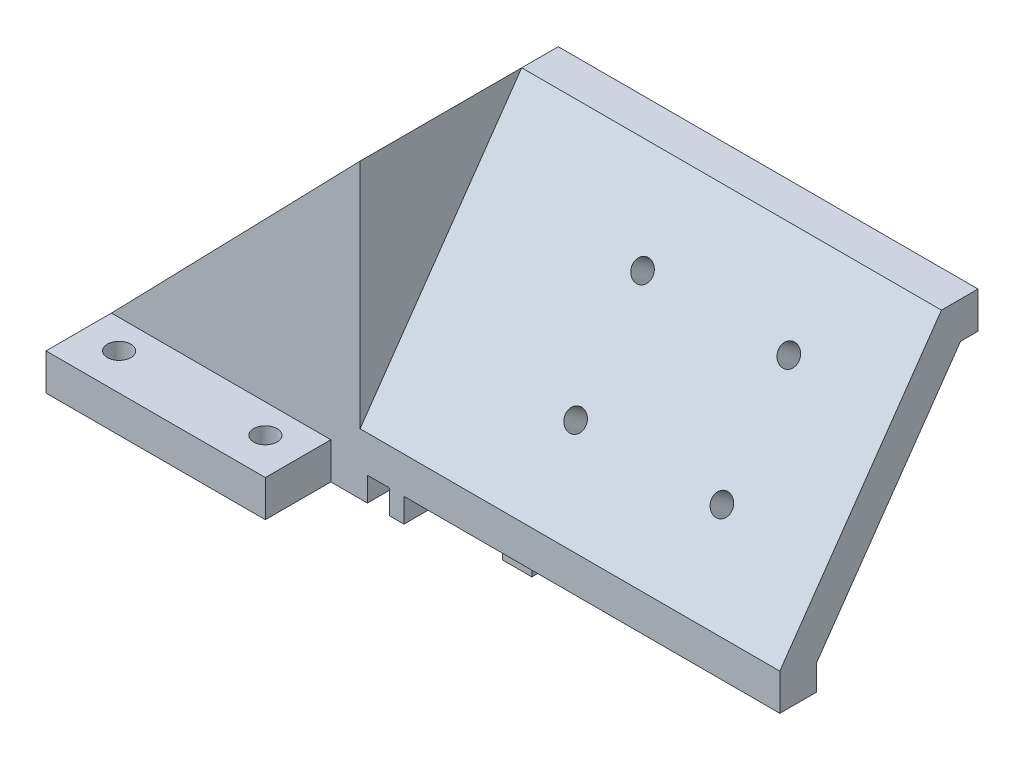
ISO-10303-21;
HEADER;
FILE_DESCRIPTION(('STEP AP214'),'2;1');
FILE_NAME('part.step','',(''),(''),'','','');
FILE_SCHEMA(('AUTOMOTIVE_DESIGN { 1 0 10303 214 1 1 1 1 }'));
ENDSEC;
DATA;
#1=APPLICATION_CONTEXT('core data for automotive mechanical design processes');
#2=APPLICATION_PROTOCOL_DEFINITION('international standard','automotive_design',2000,#1);
#3=PRODUCT_CONTEXT('',#1,'mechanical');
#4=PRODUCT('Part','Part','',(#3));
#5=PRODUCT_RELATED_PRODUCT_CATEGORY('part','',(#4));
#6=PRODUCT_DEFINITION_FORMATION('','',#4);
#7=PRODUCT_DEFINITION_CONTEXT('part definition',#1,'design');
#8=PRODUCT_DEFINITION('design','',#6,#7);
#9=PRODUCT_DEFINITION_SHAPE('','',#8);
#10=(LENGTH_UNIT() NAMED_UNIT(*) SI_UNIT(.MILLI.,.METRE.));
#11=(NAMED_UNIT(*) PLANE_ANGLE_UNIT() SI_UNIT($,.RADIAN.));
#12=(NAMED_UNIT(*) SI_UNIT($,.STERADIAN.) SOLID_ANGLE_UNIT());
#13=UNCERTAINTY_MEASURE_WITH_UNIT(LENGTH_MEASURE(1.E-05),#10,'distance_accuracy_value','');
#14=(GEOMETRIC_REPRESENTATION_CONTEXT(3) GLOBAL_UNCERTAINTY_ASSIGNED_CONTEXT((#13)) GLOBAL_UNIT_ASSIGNED_CONTEXT((#10,
#11,#12)) REPRESENTATION_CONTEXT('',''));
#15=CARTESIAN_POINT('',(0.,0.,0.));
#16=DIRECTION('',(0.,0.,1.));
#17=DIRECTION('',(1.,0.,0.));
#18=AXIS2_PLACEMENT_3D('',#15,#16,#17);
#19=CARTESIAN_POINT('',(30.,3.3,0.));
#20=DIRECTION('',(0.,1.,0.));
#21=DIRECTION('',(0.,0.,1.));
#22=AXIS2_PLACEMENT_3D('',#19,#20,#21);
#23=PLANE('',#22);
#24=DIRECTION('',(0.,0.,1.));
#25=VECTOR('',#24,1.);
#26=CARTESIAN_POINT('',(106.4,3.3,-13.55));
#27=LINE('',#26,#25);
#28=CARTESIAN_POINT('',(106.4,3.30000000000001,8.55000000000001));
#29=VERTEX_POINT('',#28);
#30=CARTESIAN_POINT('',(106.4,3.3,13.55));
#31=VERTEX_POINT('',#30);
#32=EDGE_CURVE('E465',#29,#31,#27,.T.);
#33=ORIENTED_EDGE('',*,*,#32,.T.);
#34=DIRECTION('',(1.,0.,0.));
#35=VECTOR('',#34,1.);
#36=CARTESIAN_POINT('',(30.,3.3,13.55));
#37=LINE('',#36,#35);
#38=CARTESIAN_POINT('',(55.,3.3,13.55));
#39=VERTEX_POINT('',#38);
#40=EDGE_CURVE('E334',#39,#31,#37,.T.);
#41=ORIENTED_EDGE('',*,*,#40,.F.);
#42=DIRECTION('',(0.,0.,-1.));
#43=VECTOR('',#42,1.);
#44=CARTESIAN_POINT('',(55.,3.3,0.));
#45=LINE('',#44,#43);
#46=CARTESIAN_POINT('',(55.,3.3,-13.55));
#47=VERTEX_POINT('',#46);
#48=EDGE_CURVE('E263',#39,#47,#45,.T.);
#49=ORIENTED_EDGE('',*,*,#48,.T.);
#50=DIRECTION('',(1.,0.,0.));
#51=VECTOR('',#50,1.);
#52=CARTESIAN_POINT('',(30.,3.3,-13.55));
#53=LINE('',#52,#51);
#54=CARTESIAN_POINT('',(66.,3.3,-13.55));
#55=VERTEX_POINT('',#54);
#56=EDGE_CURVE('E330',#47,#55,#53,.T.);
#57=ORIENTED_EDGE('',*,*,#56,.T.);
#58=DIRECTION('',(0.,0.,-1.));
#59=VECTOR('',#58,1.);
#60=CARTESIAN_POINT('',(66.,3.3,0.));
#61=LINE('',#60,#59);
#62=CARTESIAN_POINT('',(66.,3.3,11.05));
#63=VERTEX_POINT('',#62);
#64=EDGE_CURVE('E300',#63,#55,#61,.T.);
#65=ORIENTED_EDGE('',*,*,#64,.F.);
#66=DIRECTION('',(-1.,0.,0.));
#67=VECTOR('',#66,1.);
#68=CARTESIAN_POINT('',(30.,3.3,11.05));
#69=LINE('',#68,#67);
#70=CARTESIAN_POINT('',(70.,3.3,11.05));
#71=VERTEX_POINT('',#70);
#72=EDGE_CURVE('E314',#71,#63,#69,.T.);
#73=ORIENTED_EDGE('',*,*,#72,.F.);
#74=DIRECTION('',(0.,0.,-1.));
#75=VECTOR('',#74,1.);
#76=CARTESIAN_POINT('',(70.,3.3,0.));
#77=LINE('',#76,#75);
#78=CARTESIAN_POINT('',(70.,3.30000000000001,8.55000000000001));
#79=VERTEX_POINT('',#78);
#80=EDGE_CURVE('E304',#71,#79,#77,.T.);
#81=ORIENTED_EDGE('',*,*,#80,.T.);
#82=DIRECTION('',(-1.,0.,0.));
#83=VECTOR('',#82,1.);
#84=CARTESIAN_POINT('',(97.,3.30000000000001,8.55000000000001));
#85=LINE('',#84,#83);
#86=EDGE_CURVE('E413',#29,#79,#85,.T.);
#87=ORIENTED_EDGE('',*,*,#86,.F.);
#88=EDGE_LOOP('',(#33,#41,#49,#57,#65,#73,#81,#87));
#89=FACE_BOUND('',#88,.T.);
#90=ADVANCED_FACE('F45',(#89),#23,.F.);
#91=CARTESIAN_POINT('',(92.,8.40856632282748,-34.0678446970446));
#92=DIRECTION('',(0.,0.571898215133174,0.820324589127675));
#93=DIRECTION('',(0.,-0.820324589127675,0.571898215133174));
#94=AXIS2_PLACEMENT_3D('',#91,#92,#93);
#95=CYLINDRICAL_SURFACE('',#94,1.4);
#96=CARTESIAN_POINT('',(92.,30.7125967130213,-2.0751857210653));
#97=DIRECTION('',(0.,-0.571898215133174,-0.820324589127675));
#98=DIRECTION('',(0.,-0.820324589127675,0.571898215133174));
#99=AXIS2_PLACEMENT_3D('',#96,#97,#98);
#100=CIRCLE('',#99,1.4);
#101=CARTESIAN_POINT('',(92.,29.5641422882425,-1.27452821987885));
#102=VERTEX_POINT('',#101);
#103=EDGE_CURVE('E251',#102,#102,#100,.T.);
#104=ORIENTED_EDGE('',*,*,#103,.F.);
#105=EDGE_LOOP('',(#104));
#106=FACE_BOUND('',#105,.T.);
#107=CARTESIAN_POINT('',(92.,27.8531056373554,-6.17680866670368));
#108=DIRECTION('',(0.,0.571898215133175,0.820324589127675));
#109=DIRECTION('',(0.,0.820324589127675,-0.571898215133175));
#110=AXIS2_PLACEMENT_3D('',#107,#108,#109);
#111=CIRCLE('',#110,1.4);
#112=CARTESIAN_POINT('',(92.,29.0015600621342,-6.97746616789013));
#113=VERTEX_POINT('',#112);
#114=EDGE_CURVE('E456',#113,#113,#111,.F.);
#115=ORIENTED_EDGE('',*,*,#114,.T.);
#116=EDGE_LOOP('',(#115));
#117=FACE_BOUND('',#116,.T.);
#118=ADVANCED_FACE('F487',(#106,#117),#95,.F.);
#119=CARTESIAN_POINT('',(71.9999954707796,-4.71662710321463,-24.9174732549143));
#120=DIRECTION('',(0.,0.571898215133174,0.820324589127675));
#121=DIRECTION('',(0.,-0.820324589127675,0.571898215133174));
#122=AXIS2_PLACEMENT_3D('',#119,#120,#121);
#123=CYLINDRICAL_SURFACE('',#122,1.4);
#124=CARTESIAN_POINT('',(71.9999954707796,17.5874032869792,7.07518572106501));
#125=DIRECTION('',(0.,-0.571898215133174,-0.820324589127675));
#126=DIRECTION('',(0.,-0.820324589127675,0.571898215133174));
#127=AXIS2_PLACEMENT_3D('',#124,#125,#126);
#128=CIRCLE('',#127,1.4);
#129=CARTESIAN_POINT('',(71.9999954707796,16.4389488622004,7.87584322225145));
#130=VERTEX_POINT('',#129);
#131=EDGE_CURVE('E474',#130,#130,#128,.T.);
#132=ORIENTED_EDGE('',*,*,#131,.F.);
#133=EDGE_LOOP('',(#132));
#134=FACE_BOUND('',#133,.T.);
#135=CARTESIAN_POINT('',(71.9999954707796,14.7279122113133,2.97356277542663));
#136=DIRECTION('',(0.,0.571898215133175,0.820324589127675));
#137=DIRECTION('',(0.,0.820324589127675,-0.571898215133175));
#138=AXIS2_PLACEMENT_3D('',#135,#136,#137);
#139=CIRCLE('',#138,1.4);
#140=CARTESIAN_POINT('',(71.9999954707796,15.8763666360921,2.17290527424019));
#141=VERTEX_POINT('',#140);
#142=EDGE_CURVE('E453',#141,#141,#139,.F.);
#143=ORIENTED_EDGE('',*,*,#142,.T.);
#144=EDGE_LOOP('',(#143));
#145=FACE_BOUND('',#144,.T.);
#146=ADVANCED_FACE('F490',(#134,#145),#123,.F.);
#147=CARTESIAN_POINT('',(72.,8.40856632282771,-34.0678446970448));
#148=DIRECTION('',(0.,0.571898215133174,0.820324589127675));
#149=DIRECTION('',(0.,-0.820324589127675,0.571898215133174));
#150=AXIS2_PLACEMENT_3D('',#147,#148,#149);
#151=CYLINDRICAL_SURFACE('',#150,1.4);
#152=CARTESIAN_POINT('',(72.,30.7125967130215,-2.07518572106546));
#153=DIRECTION('',(0.,-0.571898215133174,-0.820324589127675));
#154=DIRECTION('',(0.,-0.820324589127675,0.571898215133174));
#155=AXIS2_PLACEMENT_3D('',#152,#153,#154);
#156=CIRCLE('',#155,1.4);
#157=CARTESIAN_POINT('',(72.,29.5641422882428,-1.27452821987901));
#158=VERTEX_POINT('',#157);
#159=EDGE_CURVE('E477',#158,#158,#156,.T.);
#160=ORIENTED_EDGE('',*,*,#159,.F.);
#161=EDGE_LOOP('',(#160));
#162=FACE_BOUND('',#161,.T.);
#163=CARTESIAN_POINT('',(72.,27.8531056373556,-6.17680866670384));
#164=DIRECTION('',(0.,0.571898215133175,0.820324589127675));
#165=DIRECTION('',(0.,0.820324589127675,-0.571898215133175));
#166=AXIS2_PLACEMENT_3D('',#163,#164,#165);
#167=CIRCLE('',#166,1.4);
#168=CARTESIAN_POINT('',(72.,29.0015600621344,-6.97746616789029));
#169=VERTEX_POINT('',#168);
#170=EDGE_CURVE('E412',#169,#169,#167,.F.);
#171=ORIENTED_EDGE('',*,*,#170,.T.);
#172=EDGE_LOOP('',(#171));
#173=FACE_BOUND('',#172,.T.);
#174=ADVANCED_FACE('F687',(#162,#173),#151,.F.);
#175=CARTESIAN_POINT('',(91.9999954707796,-4.7166271032148,-24.9174732549142));
#176=DIRECTION('',(0.,0.571898215133174,0.820324589127675));
#177=DIRECTION('',(0.,-0.820324589127675,0.571898215133174));
#178=AXIS2_PLACEMENT_3D('',#175,#176,#177);
#179=CYLINDRICAL_SURFACE('',#178,1.4);
#180=CARTESIAN_POINT('',(91.9999954707796,17.587403286979,7.07518572106513));
#181=DIRECTION('',(0.,-0.571898215133174,-0.820324589127675));
#182=DIRECTION('',(0.,-0.820324589127675,0.571898215133174));
#183=AXIS2_PLACEMENT_3D('',#180,#181,#182);
#184=CIRCLE('',#183,1.4);
#185=CARTESIAN_POINT('',(91.9999954707796,16.4389488622003,7.87584322225157));
#186=VERTEX_POINT('',#185);
#187=EDGE_CURVE('E473',#186,#186,#184,.T.);
#188=ORIENTED_EDGE('',*,*,#187,.F.);
#189=EDGE_LOOP('',(#188));
#190=FACE_BOUND('',#189,.T.);
#191=CARTESIAN_POINT('',(91.9999954707796,14.7279122113131,2.97356277542675));
#192=DIRECTION('',(0.,0.571898215133175,0.820324589127675));
#193=DIRECTION('',(0.,0.820324589127675,-0.571898215133175));
#194=AXIS2_PLACEMENT_3D('',#191,#192,#193);
#195=CIRCLE('',#194,1.4);
#196=CARTESIAN_POINT('',(91.9999954707796,15.8763666360919,2.1729052742403));
#197=VERTEX_POINT('',#196);
#198=EDGE_CURVE('E409',#197,#197,#195,.F.);
#199=ORIENTED_EDGE('',*,*,#198,.T.);
#200=EDGE_LOOP('',(#199));
#201=FACE_BOUND('',#200,.T.);
#202=ADVANCED_FACE('F683',(#190,#201),#179,.F.);
#203=CARTESIAN_POINT('',(30.,3.3,13.55));
#204=DIRECTION('',(0.,0.,-1.));
#205=DIRECTION('',(1.,0.,0.));
#206=AXIS2_PLACEMENT_3D('',#203,#204,#205);
#207=PLANE('',#206);
#208=DIRECTION('',(1.,0.,0.));
#209=VECTOR('',#208,1.);
#210=CARTESIAN_POINT('',(30.,5.,13.55));
#211=LINE('',#210,#209);
#212=CARTESIAN_POINT('',(15.,5.,13.55));
#213=VERTEX_POINT('',#212);
#214=CARTESIAN_POINT('',(45.,5.,13.55));
#215=VERTEX_POINT('',#214);
#216=EDGE_CURVE('E401',#213,#215,#211,.T.);
#217=ORIENTED_EDGE('',*,*,#216,.T.);
#218=DIRECTION('',(0.,1.,0.));
#219=VECTOR('',#218,1.);
#220=CARTESIAN_POINT('',(45.,5.,13.55));
#221=LINE('',#220,#219);
#222=CARTESIAN_POINT('',(45.,0.,13.55));
#223=VERTEX_POINT('',#222);
#224=EDGE_CURVE('E338',#223,#215,#221,.T.);
#225=ORIENTED_EDGE('',*,*,#224,.F.);
#226=DIRECTION('',(1.,0.,0.));
#227=VECTOR('',#226,1.);
#228=CARTESIAN_POINT('',(30.,0.,13.55));
#229=LINE('',#228,#227);
#230=CARTESIAN_POINT('',(50.,0.,13.55));
#231=VERTEX_POINT('',#230);
#232=EDGE_CURVE('E285',#223,#231,#229,.T.);
#233=ORIENTED_EDGE('',*,*,#232,.T.);
#234=DIRECTION('',(0.,1.,0.));
#235=VECTOR('',#234,1.);
#236=CARTESIAN_POINT('',(50.,0.,13.55));
#237=LINE('',#236,#235);
#238=CARTESIAN_POINT('',(50.,3.3,13.55));
#239=VERTEX_POINT('',#238);
#240=EDGE_CURVE('E297',#231,#239,#237,.T.);
#241=ORIENTED_EDGE('',*,*,#240,.T.);
#242=CARTESIAN_POINT('',(53.,3.3,13.55));
#243=VERTEX_POINT('',#242);
#244=EDGE_CURVE('E335',#239,#243,#37,.T.);
#245=ORIENTED_EDGE('',*,*,#244,.T.);
#246=DIRECTION('',(0.,1.,0.));
#247=VECTOR('',#246,1.);
#248=CARTESIAN_POINT('',(53.,0.,13.55));
#249=LINE('',#248,#247);
#250=CARTESIAN_POINT('',(53.,0.,13.55));
#251=VERTEX_POINT('',#250);
#252=EDGE_CURVE('E281',#251,#243,#249,.T.);
#253=ORIENTED_EDGE('',*,*,#252,.F.);
#254=DIRECTION('',(1.,0.,0.));
#255=VECTOR('',#254,1.);
#256=CARTESIAN_POINT('',(30.,0.,13.55));
#257=LINE('',#256,#255);
#258=CARTESIAN_POINT('',(55.,0.,13.55));
#259=VERTEX_POINT('',#258);
#260=EDGE_CURVE('E262',#251,#259,#257,.T.);
#261=ORIENTED_EDGE('',*,*,#260,.T.);
#262=DIRECTION('',(0.,1.,0.));
#263=VECTOR('',#262,1.);
#264=CARTESIAN_POINT('',(55.,0.,13.55));
#265=LINE('',#264,#263);
#266=EDGE_CURVE('E279',#259,#39,#265,.T.);
#267=ORIENTED_EDGE('',*,*,#266,.T.);
#268=ORIENTED_EDGE('',*,*,#40,.T.);
#269=DIRECTION('',(0.,1.,0.));
#270=VECTOR('',#269,1.);
#271=CARTESIAN_POINT('',(106.4,40.,13.55));
#272=LINE('',#271,#270);
#273=CARTESIAN_POINT('',(106.4,8.3,13.55));
#274=VERTEX_POINT('',#273);
#275=EDGE_CURVE('E468',#31,#274,#272,.T.);
#276=ORIENTED_EDGE('',*,*,#275,.T.);
#277=DIRECTION('',(1.,0.,0.));
#278=VECTOR('',#277,1.);
#279=CARTESIAN_POINT('',(49.,8.3,13.55));
#280=LINE('',#279,#278);
#281=CARTESIAN_POINT('',(49.,8.3,13.55));
#282=VERTEX_POINT('',#281);
#283=EDGE_CURVE('E233',#282,#274,#280,.T.);
#284=ORIENTED_EDGE('',*,*,#283,.F.);
#285=DIRECTION('',(0.,1.,0.));
#286=VECTOR('',#285,1.);
#287=CARTESIAN_POINT('',(49.,0.,13.55));
#288=LINE('',#287,#286);
#289=CARTESIAN_POINT('',(49.,40.,13.55));
#290=VERTEX_POINT('',#289);
#291=EDGE_CURVE('E227',#282,#290,#288,.T.);
#292=ORIENTED_EDGE('',*,*,#291,.T.);
#293=DIRECTION('',(-0.696785684263249,-0.717279380859227,0.));
#294=VECTOR('',#293,1.);
#295=CARTESIAN_POINT('',(49.,40.,13.55));
#296=LINE('',#295,#294);
#297=EDGE_CURVE('E236',#290,#213,#296,.T.);
#298=ORIENTED_EDGE('',*,*,#297,.T.);
#299=EDGE_LOOP('',(#217,#225,#233,#241,#245,#253,#261,#267,#268,#276,#284,#292,#298));
#300=FACE_BOUND('',#299,.T.);
#301=ADVANCED_FACE('F247',(#300),#207,.F.);
#302=CARTESIAN_POINT('',(30.,40.,0.));
#303=DIRECTION('',(0.,1.,0.));
#304=DIRECTION('',(0.,0.,1.));
#305=AXIS2_PLACEMENT_3D('',#302,#303,#304);
#306=PLANE('',#305);
#307=DIRECTION('',(0.,0.,1.));
#308=VECTOR('',#307,1.);
#309=CARTESIAN_POINT('',(49.,40.,-22.5));
#310=LINE('',#309,#308);
#311=CARTESIAN_POINT('',(49.,40.,-13.55));
#312=VERTEX_POINT('',#311);
#313=CARTESIAN_POINT('',(49.,40.,-8.54999999999998));
#314=VERTEX_POINT('',#313);
#315=EDGE_CURVE('E245',#312,#314,#310,.T.);
#316=ORIENTED_EDGE('',*,*,#315,.T.);
#317=DIRECTION('',(1.,0.,0.));
#318=VECTOR('',#317,1.);
#319=CARTESIAN_POINT('',(49.,40.,-8.54999999999998));
#320=LINE('',#319,#318);
#321=CARTESIAN_POINT('',(106.4,40.,-8.54999999999999));
#322=VERTEX_POINT('',#321);
#323=EDGE_CURVE('E255',#314,#322,#320,.T.);
#324=ORIENTED_EDGE('',*,*,#323,.T.);
#325=DIRECTION('',(0.,0.,-1.));
#326=VECTOR('',#325,1.);
#327=CARTESIAN_POINT('',(106.4,40.,-13.55));
#328=LINE('',#327,#326);
#329=CARTESIAN_POINT('',(106.4,40.,-13.55));
#330=VERTEX_POINT('',#329);
#331=EDGE_CURVE('E470',#322,#330,#328,.T.);
#332=ORIENTED_EDGE('',*,*,#331,.T.);
#333=DIRECTION('',(1.,0.,0.));
#334=VECTOR('',#333,1.);
#335=CARTESIAN_POINT('',(30.,40.,-13.55));
#336=LINE('',#335,#334);
#337=EDGE_CURVE('E327',#312,#330,#336,.T.);
#338=ORIENTED_EDGE('',*,*,#337,.F.);
#339=EDGE_LOOP('',(#316,#324,#332,#338));
#340=FACE_BOUND('',#339,.T.);
#341=ADVANCED_FACE('F568',(#340),#306,.T.);
#342=CARTESIAN_POINT('',(30.,3.3,-13.55));
#343=DIRECTION('',(0.,0.,-1.));
#344=DIRECTION('',(1.,0.,0.));
#345=AXIS2_PLACEMENT_3D('',#342,#343,#344);
#346=PLANE('',#345);
#347=DIRECTION('',(0.696785684263249,0.717279380859227,0.));
#348=VECTOR('',#347,1.);
#349=CARTESIAN_POINT('',(21.4330113397732,11.6222175556489,-13.55));
#350=LINE('',#349,#348);
#351=CARTESIAN_POINT('',(15.,5.,-13.55));
#352=VERTEX_POINT('',#351);
#353=EDGE_CURVE('E570',#352,#312,#350,.T.);
#354=ORIENTED_EDGE('',*,*,#353,.T.);
#355=ORIENTED_EDGE('',*,*,#337,.T.);
#356=DIRECTION('',(0.,-1.,0.));
#357=VECTOR('',#356,1.);
#358=CARTESIAN_POINT('',(106.4,40.,-13.55));
#359=LINE('',#358,#357);
#360=CARTESIAN_POINT('',(106.4,35.,-13.55));
#361=VERTEX_POINT('',#360);
#362=EDGE_CURVE('E462',#330,#361,#359,.T.);
#363=ORIENTED_EDGE('',*,*,#362,.T.);
#364=DIRECTION('',(-1.,0.,0.));
#365=VECTOR('',#364,1.);
#366=CARTESIAN_POINT('',(97.,35.,-13.55));
#367=LINE('',#366,#365);
#368=CARTESIAN_POINT('',(67.0003780655682,35.,-13.55));
#369=VERTEX_POINT('',#368);
#370=EDGE_CURVE('E439',#361,#369,#367,.T.);
#371=ORIENTED_EDGE('',*,*,#370,.T.);
#372=CARTESIAN_POINT('',(69.,34.9320054204283,-13.55));
#373=DIRECTION('',(0.,0.,1.));
#374=DIRECTION('',(0.,-1.,0.));
#375=AXIS2_PLACEMENT_3D('',#372,#373,#374);
#376=ELLIPSE('',#375,3.49712579455117,2.);
#377=CARTESIAN_POINT('',(67.,34.9320054204283,-13.55));
#378=VERTEX_POINT('',#377);
#379=EDGE_CURVE('E11',#378,#369,#376,.F.);
#380=ORIENTED_EDGE('',*,*,#379,.F.);
#381=DIRECTION('',(0.,-1.,0.));
#382=VECTOR('',#381,1.);
#383=CARTESIAN_POINT('',(67.,35.,-13.55));
#384=LINE('',#383,#382);
#385=CARTESIAN_POINT('',(67.,3.3,-13.55));
#386=VERTEX_POINT('',#385);
#387=EDGE_CURVE('E429',#378,#386,#384,.T.);
#388=ORIENTED_EDGE('',*,*,#387,.T.);
#389=DIRECTION('',(-1.,0.,0.));
#390=VECTOR('',#389,1.);
#391=CARTESIAN_POINT('',(97.,3.3,-13.55));
#392=LINE('',#391,#390);
#393=CARTESIAN_POINT('',(70.,3.3,-13.55));
#394=VERTEX_POINT('',#393);
#395=EDGE_CURVE('E426',#394,#386,#392,.T.);
#396=ORIENTED_EDGE('',*,*,#395,.F.);
#397=DIRECTION('',(0.,1.,0.));
#398=VECTOR('',#397,1.);
#399=CARTESIAN_POINT('',(70.,0.,-13.55));
#400=LINE('',#399,#398);
#401=CARTESIAN_POINT('',(70.,0.,-13.55));
#402=VERTEX_POINT('',#401);
#403=EDGE_CURVE('E320',#402,#394,#400,.T.);
#404=ORIENTED_EDGE('',*,*,#403,.F.);
#405=DIRECTION('',(-1.,0.,0.));
#406=VECTOR('',#405,1.);
#407=CARTESIAN_POINT('',(30.,0.,-13.55));
#408=LINE('',#407,#406);
#409=CARTESIAN_POINT('',(66.,0.,-13.55));
#410=VERTEX_POINT('',#409);
#411=EDGE_CURVE('E308',#402,#410,#408,.T.);
#412=ORIENTED_EDGE('',*,*,#411,.T.);
#413=DIRECTION('',(0.,1.,0.));
#414=VECTOR('',#413,1.);
#415=CARTESIAN_POINT('',(66.,0.,-13.55));
#416=LINE('',#415,#414);
#417=EDGE_CURVE('E311',#410,#55,#416,.T.);
#418=ORIENTED_EDGE('',*,*,#417,.T.);
#419=ORIENTED_EDGE('',*,*,#56,.F.);
#420=DIRECTION('',(0.,1.,0.));
#421=VECTOR('',#420,1.);
#422=CARTESIAN_POINT('',(55.,0.,-13.55));
#423=LINE('',#422,#421);
#424=CARTESIAN_POINT('',(55.,0.,-13.55));
#425=VERTEX_POINT('',#424);
#426=EDGE_CURVE('E277',#425,#47,#423,.T.);
#427=ORIENTED_EDGE('',*,*,#426,.F.);
#428=DIRECTION('',(-1.,0.,0.));
#429=VECTOR('',#428,1.);
#430=CARTESIAN_POINT('',(30.,0.,-13.55));
#431=LINE('',#430,#429);
#432=CARTESIAN_POINT('',(53.,0.,-13.55));
#433=VERTEX_POINT('',#432);
#434=EDGE_CURVE('E268',#425,#433,#431,.T.);
#435=ORIENTED_EDGE('',*,*,#434,.T.);
#436=DIRECTION('',(0.,1.,0.));
#437=VECTOR('',#436,1.);
#438=CARTESIAN_POINT('',(53.,0.,-13.55));
#439=LINE('',#438,#437);
#440=CARTESIAN_POINT('',(53.,3.3,-13.55));
#441=VERTEX_POINT('',#440);
#442=EDGE_CURVE('E271',#433,#441,#439,.T.);
#443=ORIENTED_EDGE('',*,*,#442,.T.);
#444=CARTESIAN_POINT('',(50.,3.3,-13.55));
#445=VERTEX_POINT('',#444);
#446=EDGE_CURVE('E331',#445,#441,#53,.T.);
#447=ORIENTED_EDGE('',*,*,#446,.F.);
#448=DIRECTION('',(0.,1.,0.));
#449=VECTOR('',#448,1.);
#450=CARTESIAN_POINT('',(50.,0.,-13.55));
#451=LINE('',#450,#449);
#452=CARTESIAN_POINT('',(50.,0.,-13.55));
#453=VERTEX_POINT('',#452);
#454=EDGE_CURVE('E293',#453,#445,#451,.T.);
#455=ORIENTED_EDGE('',*,*,#454,.F.);
#456=DIRECTION('',(-1.,0.,0.));
#457=VECTOR('',#456,1.);
#458=CARTESIAN_POINT('',(30.,0.,-13.55));
#459=LINE('',#458,#457);
#460=CARTESIAN_POINT('',(45.,0.,-13.55));
#461=VERTEX_POINT('',#460);
#462=EDGE_CURVE('E290',#453,#461,#459,.T.);
#463=ORIENTED_EDGE('',*,*,#462,.T.);
#464=DIRECTION('',(0.,1.,0.));
#465=VECTOR('',#464,1.);
#466=CARTESIAN_POINT('',(45.,5.,-13.55));
#467=LINE('',#466,#465);
#468=CARTESIAN_POINT('',(45.,5.,-13.55));
#469=VERTEX_POINT('',#468);
#470=EDGE_CURVE('E341',#461,#469,#467,.T.);
#471=ORIENTED_EDGE('',*,*,#470,.T.);
#472=DIRECTION('',(1.,0.,0.));
#473=VECTOR('',#472,1.);
#474=CARTESIAN_POINT('',(30.,5.,-13.55));
#475=LINE('',#474,#473);
#476=EDGE_CURVE('E403',#352,#469,#475,.T.);
#477=ORIENTED_EDGE('',*,*,#476,.F.);
#478=EDGE_LOOP('',(#354,#355,#363,#371,#380,#388,#396,#404,#412,#418,#419,#427,#435,#443,#447,
#455,#463,#471,#477));
#479=FACE_BOUND('',#478,.T.);
#480=ADVANCED_FACE('F543',(#479),#346,.T.);
#481=CARTESIAN_POINT('',(49.,9.07153719949107,13.0121144445189));
#482=DIRECTION('',(0.,0.571898215133175,0.820324589127675));
#483=DIRECTION('',(0.,-0.820324589127675,0.571898215133174));
#484=AXIS2_PLACEMENT_3D('',#481,#482,#483);
#485=PLANE('',#484);
#486=ORIENTED_EDGE('',*,*,#187,.T.);
#487=EDGE_LOOP('',(#486));
#488=FACE_BOUND('',#487,.T.);
#489=ORIENTED_EDGE('',*,*,#159,.T.);
#490=EDGE_LOOP('',(#489));
#491=FACE_BOUND('',#490,.T.);
#492=ORIENTED_EDGE('',*,*,#131,.T.);
#493=EDGE_LOOP('',(#492));
#494=FACE_BOUND('',#493,.T.);
#495=ORIENTED_EDGE('',*,*,#103,.T.);
#496=EDGE_LOOP('',(#495));
#497=FACE_BOUND('',#496,.T.);
#498=ORIENTED_EDGE('',*,*,#323,.F.);
#499=DIRECTION('',(0.,0.820324589127675,-0.571898215133174));
#500=VECTOR('',#499,1.);
#501=CARTESIAN_POINT('',(49.,9.07153719949107,13.0121144445189));
#502=LINE('',#501,#500);
#503=EDGE_CURVE('E229',#282,#314,#502,.T.);
#504=ORIENTED_EDGE('',*,*,#503,.F.);
#505=ORIENTED_EDGE('',*,*,#283,.T.);
#506=DIRECTION('',(0.,-0.820324589127675,0.571898215133174));
#507=VECTOR('',#506,1.);
#508=CARTESIAN_POINT('',(106.4,9.07153719949107,13.0121144445189));
#509=LINE('',#508,#507);
#510=EDGE_CURVE('E406',#322,#274,#509,.T.);
#511=ORIENTED_EDGE('',*,*,#510,.F.);
#512=EDGE_LOOP('',(#498,#504,#505,#511));
#513=FACE_BOUND('',#512,.T.);
#514=ADVANCED_FACE('F484',(#488,#491,#494,#497,#513),#485,.T.);
#515=CARTESIAN_POINT('',(45.,5.,0.));
#516=DIRECTION('',(-1.,0.,0.));
#517=DIRECTION('',(0.,0.,-1.));
#518=AXIS2_PLACEMENT_3D('',#515,#516,#517);
#519=PLANE('',#518);
#520=ORIENTED_EDGE('',*,*,#224,.T.);
#521=DIRECTION('',(0.,0.,1.));
#522=VECTOR('',#521,1.);
#523=CARTESIAN_POINT('',(45.,5.,0.));
#524=LINE('',#523,#522);
#525=CARTESIAN_POINT('',(45.,5.,22.5));
#526=VERTEX_POINT('',#525);
#527=EDGE_CURVE('E363',#215,#526,#524,.T.);
#528=ORIENTED_EDGE('',*,*,#527,.T.);
#529=DIRECTION('',(0.,-1.,0.));
#530=VECTOR('',#529,1.);
#531=CARTESIAN_POINT('',(45.,5.,22.5));
#532=LINE('',#531,#530);
#533=CARTESIAN_POINT('',(45.,0.,22.5));
#534=VERTEX_POINT('',#533);
#535=EDGE_CURVE('E392',#526,#534,#532,.T.);
#536=ORIENTED_EDGE('',*,*,#535,.T.);
#537=DIRECTION('',(0.,0.,1.));
#538=VECTOR('',#537,1.);
#539=CARTESIAN_POINT('',(45.,0.,0.));
#540=LINE('',#539,#538);
#541=EDGE_CURVE('E386',#223,#534,#540,.T.);
#542=ORIENTED_EDGE('',*,*,#541,.F.);
#543=EDGE_LOOP('',(#520,#528,#536,#542));
#544=FACE_BOUND('',#543,.T.);
#545=ADVANCED_FACE('F529',(#544),#519,.F.);
#546=CARTESIAN_POINT('',(45.,0.,-22.5));
#547=VERTEX_POINT('',#546);
#548=EDGE_CURVE('E387',#547,#461,#540,.T.);
#549=ORIENTED_EDGE('',*,*,#548,.F.);
#550=DIRECTION('',(0.,-1.,0.));
#551=VECTOR('',#550,1.);
#552=CARTESIAN_POINT('',(45.,5.,-22.5));
#553=LINE('',#552,#551);
#554=CARTESIAN_POINT('',(45.,5.,-22.5));
#555=VERTEX_POINT('',#554);
#556=EDGE_CURVE('E395',#555,#547,#553,.T.);
#557=ORIENTED_EDGE('',*,*,#556,.F.);
#558=EDGE_CURVE('E364',#555,#469,#524,.T.);
#559=ORIENTED_EDGE('',*,*,#558,.T.);
#560=ORIENTED_EDGE('',*,*,#470,.F.);
#561=EDGE_LOOP('',(#549,#557,#559,#560));
#562=FACE_BOUND('',#561,.T.);
#563=ADVANCED_FACE('F519',(#562),#519,.F.);
#564=ORIENTED_EDGE('',*,*,#244,.F.);
#565=DIRECTION('',(0.,0.,-1.));
#566=VECTOR('',#565,1.);
#567=CARTESIAN_POINT('',(50.,3.3,0.));
#568=LINE('',#567,#566);
#569=EDGE_CURVE('E284',#239,#445,#568,.T.);
#570=ORIENTED_EDGE('',*,*,#569,.T.);
#571=ORIENTED_EDGE('',*,*,#446,.T.);
#572=DIRECTION('',(0.,0.,-1.));
#573=VECTOR('',#572,1.);
#574=CARTESIAN_POINT('',(53.,3.3,0.));
#575=LINE('',#574,#573);
#576=EDGE_CURVE('E258',#243,#441,#575,.T.);
#577=ORIENTED_EDGE('',*,*,#576,.F.);
#578=EDGE_LOOP('',(#564,#570,#571,#577));
#579=FACE_BOUND('',#578,.T.);
#580=ADVANCED_FACE('F512',(#579),#23,.F.);
#581=CARTESIAN_POINT('',(30.,5.,0.));
#582=DIRECTION('',(0.,1.,0.));
#583=DIRECTION('',(0.,0.,1.));
#584=AXIS2_PLACEMENT_3D('',#581,#582,#583);
#585=PLANE('',#584);
#586=CARTESIAN_POINT('',(19.9999999999998,5.,17.5));
#587=DIRECTION('',(0.,-1.,0.));
#588=DIRECTION('',(0.,0.,1.));
#589=AXIS2_PLACEMENT_3D('',#586,#587,#588);
#590=CIRCLE('',#589,1.6);
#591=CARTESIAN_POINT('',(19.9999999999998,5.,19.1));
#592=VERTEX_POINT('',#591);
#593=EDGE_CURVE('E348',#592,#592,#590,.T.);
#594=ORIENTED_EDGE('',*,*,#593,.T.);
#595=EDGE_LOOP('',(#594));
#596=FACE_BOUND('',#595,.T.);
#597=CARTESIAN_POINT('',(39.9999999999998,5.,17.5));
#598=DIRECTION('',(0.,-1.,0.));
#599=DIRECTION('',(0.,0.,1.));
#600=AXIS2_PLACEMENT_3D('',#597,#598,#599);
#601=CIRCLE('',#600,1.6);
#602=CARTESIAN_POINT('',(39.9999999999998,5.,19.1));
#603=VERTEX_POINT('',#602);
#604=EDGE_CURVE('E345',#603,#603,#601,.T.);
#605=ORIENTED_EDGE('',*,*,#604,.T.);
#606=EDGE_LOOP('',(#605));
#607=FACE_BOUND('',#606,.T.);
#608=DIRECTION('',(0.,0.,1.));
#609=VECTOR('',#608,1.);
#610=CARTESIAN_POINT('',(15.,5.,0.));
#611=LINE('',#610,#609);
#612=CARTESIAN_POINT('',(15.,5.,22.5));
#613=VERTEX_POINT('',#612);
#614=EDGE_CURVE('E358',#213,#613,#611,.T.);
#615=ORIENTED_EDGE('',*,*,#614,.T.);
#616=DIRECTION('',(-1.,0.,0.));
#617=VECTOR('',#616,1.);
#618=CARTESIAN_POINT('',(30.,5.,22.5));
#619=LINE('',#618,#617);
#620=EDGE_CURVE('E366',#526,#613,#619,.T.);
#621=ORIENTED_EDGE('',*,*,#620,.F.);
#622=ORIENTED_EDGE('',*,*,#527,.F.);
#623=ORIENTED_EDGE('',*,*,#216,.F.);
#624=EDGE_LOOP('',(#615,#621,#622,#623));
#625=FACE_BOUND('',#624,.T.);
#626=ADVANCED_FACE('F518',(#596,#607,#625),#585,.T.);
#627=CARTESIAN_POINT('',(15.,5.,0.));
#628=DIRECTION('',(-1.,0.,0.));
#629=DIRECTION('',(0.,0.,-1.));
#630=AXIS2_PLACEMENT_3D('',#627,#628,#629);
#631=PLANE('',#630);
#632=DIRECTION('',(0.,0.,1.));
#633=VECTOR('',#632,1.);
#634=CARTESIAN_POINT('',(15.,5.,-22.5));
#635=LINE('',#634,#633);
#636=EDGE_CURVE('E240',#352,#213,#635,.T.);
#637=ORIENTED_EDGE('',*,*,#636,.F.);
#638=CARTESIAN_POINT('',(15.,5.,-22.5));
#639=VERTEX_POINT('',#638);
#640=EDGE_CURVE('E359',#639,#352,#611,.T.);
#641=ORIENTED_EDGE('',*,*,#640,.F.);
#642=DIRECTION('',(0.,-1.,0.));
#643=VECTOR('',#642,1.);
#644=CARTESIAN_POINT('',(15.,5.,-22.5));
#645=LINE('',#644,#643);
#646=CARTESIAN_POINT('',(15.,0.,-22.5));
#647=VERTEX_POINT('',#646);
#648=EDGE_CURVE('E398',#639,#647,#645,.T.);
#649=ORIENTED_EDGE('',*,*,#648,.T.);
#650=DIRECTION('',(0.,0.,1.));
#651=VECTOR('',#650,1.);
#652=CARTESIAN_POINT('',(15.,0.,0.));
#653=LINE('',#652,#651);
#654=CARTESIAN_POINT('',(15.,0.,22.5));
#655=VERTEX_POINT('',#654);
#656=EDGE_CURVE('E381',#647,#655,#653,.T.);
#657=ORIENTED_EDGE('',*,*,#656,.T.);
#658=DIRECTION('',(0.,-1.,0.));
#659=VECTOR('',#658,1.);
#660=CARTESIAN_POINT('',(15.,5.,22.5));
#661=LINE('',#660,#659);
#662=EDGE_CURVE('E369',#613,#655,#661,.T.);
#663=ORIENTED_EDGE('',*,*,#662,.F.);
#664=ORIENTED_EDGE('',*,*,#614,.F.);
#665=EDGE_LOOP('',(#637,#641,#649,#657,#663,#664));
#666=FACE_BOUND('',#665,.T.);
#667=ADVANCED_FACE('F525',(#666),#631,.T.);
#668=CARTESIAN_POINT('',(30.,5.,-22.5));
#669=DIRECTION('',(0.,0.,-1.));
#670=DIRECTION('',(1.,0.,0.));
#671=AXIS2_PLACEMENT_3D('',#668,#669,#670);
#672=PLANE('',#671);
#673=DIRECTION('',(-1.,0.,0.));
#674=VECTOR('',#673,1.);
#675=CARTESIAN_POINT('',(30.,0.,-22.5));
#676=LINE('',#675,#674);
#677=EDGE_CURVE('E384',#547,#647,#676,.T.);
#678=ORIENTED_EDGE('',*,*,#677,.T.);
#679=ORIENTED_EDGE('',*,*,#648,.F.);
#680=DIRECTION('',(-1.,0.,0.));
#681=VECTOR('',#680,1.);
#682=CARTESIAN_POINT('',(30.,5.,-22.5));
#683=LINE('',#682,#681);
#684=EDGE_CURVE('E361',#555,#639,#683,.T.);
#685=ORIENTED_EDGE('',*,*,#684,.F.);
#686=ORIENTED_EDGE('',*,*,#556,.T.);
#687=EDGE_LOOP('',(#678,#679,#685,#686));
#688=FACE_BOUND('',#687,.T.);
#689=ADVANCED_FACE('F619',(#688),#672,.T.);
#690=CARTESIAN_POINT('',(40.,5.,-17.5));
#691=DIRECTION('',(0.,-1.,0.));
#692=DIRECTION('',(0.,0.,-1.));
#693=AXIS2_PLACEMENT_3D('',#690,#691,#692);
#694=CYLINDRICAL_SURFACE('',#693,1.6);
#695=CARTESIAN_POINT('',(40.,5.,-17.5));
#696=DIRECTION('',(0.,-1.,0.));
#697=DIRECTION('',(0.,0.,1.));
#698=AXIS2_PLACEMENT_3D('',#695,#696,#697);
#699=CIRCLE('',#698,1.6);
#700=CARTESIAN_POINT('',(40.,5.,-15.9));
#701=VERTEX_POINT('',#700);
#702=EDGE_CURVE('E355',#701,#701,#699,.T.);
#703=ORIENTED_EDGE('',*,*,#702,.F.);
#704=EDGE_LOOP('',(#703));
#705=FACE_BOUND('',#704,.T.);
#706=CARTESIAN_POINT('',(40.,0.,-17.5));
#707=DIRECTION('',(0.,-1.,0.));
#708=DIRECTION('',(0.,0.,1.));
#709=AXIS2_PLACEMENT_3D('',#706,#707,#708);
#710=CIRCLE('',#709,1.6);
#711=CARTESIAN_POINT('',(40.,0.,-15.9));
#712=VERTEX_POINT('',#711);
#713=EDGE_CURVE('E378',#712,#712,#710,.T.);
#714=ORIENTED_EDGE('',*,*,#713,.T.);
#715=EDGE_LOOP('',(#714));
#716=FACE_BOUND('',#715,.T.);
#717=ADVANCED_FACE('F636',(#705,#716),#694,.F.);
#718=CARTESIAN_POINT('',(20.,5.,-17.5));
#719=DIRECTION('',(0.,-1.,0.));
#720=DIRECTION('',(0.,0.,-1.));
#721=AXIS2_PLACEMENT_3D('',#718,#719,#720);
#722=CYLINDRICAL_SURFACE('',#721,1.6);
#723=CARTESIAN_POINT('',(20.,5.,-17.5));
#724=DIRECTION('',(0.,-1.,0.));
#725=DIRECTION('',(0.,0.,1.));
#726=AXIS2_PLACEMENT_3D('',#723,#724,#725);
#727=CIRCLE('',#726,1.6);
#728=CARTESIAN_POINT('',(20.,5.,-15.9));
#729=VERTEX_POINT('',#728);
#730=EDGE_CURVE('E352',#729,#729,#727,.T.);
#731=ORIENTED_EDGE('',*,*,#730,.F.);
#732=EDGE_LOOP('',(#731));
#733=FACE_BOUND('',#732,.T.);
#734=CARTESIAN_POINT('',(20.,0.,-17.5));
#735=DIRECTION('',(0.,-1.,0.));
#736=DIRECTION('',(0.,0.,1.));
#737=AXIS2_PLACEMENT_3D('',#734,#735,#736);
#738=CIRCLE('',#737,1.6);
#739=CARTESIAN_POINT('',(20.,0.,-15.9));
#740=VERTEX_POINT('',#739);
#741=EDGE_CURVE('E375',#740,#740,#738,.T.);
#742=ORIENTED_EDGE('',*,*,#741,.T.);
#743=EDGE_LOOP('',(#742));
#744=FACE_BOUND('',#743,.T.);
#745=ADVANCED_FACE('F641',(#733,#744),#722,.F.);
#746=CARTESIAN_POINT('',(19.9999999999998,5.,17.5));
#747=DIRECTION('',(0.,-1.,0.));
#748=DIRECTION('',(0.,0.,-1.));
#749=AXIS2_PLACEMENT_3D('',#746,#747,#748);
#750=CYLINDRICAL_SURFACE('',#749,1.6);
#751=ORIENTED_EDGE('',*,*,#593,.F.);
#752=EDGE_LOOP('',(#751));
#753=FACE_BOUND('',#752,.T.);
#754=CARTESIAN_POINT('',(19.9999999999998,0.,17.5));
#755=DIRECTION('',(0.,-1.,0.));
#756=DIRECTION('',(0.,0.,1.));
#757=AXIS2_PLACEMENT_3D('',#754,#755,#756);
#758=CIRCLE('',#757,1.6);
#759=CARTESIAN_POINT('',(19.9999999999998,0.,19.1));
#760=VERTEX_POINT('',#759);
#761=EDGE_CURVE('E372',#760,#760,#758,.T.);
#762=ORIENTED_EDGE('',*,*,#761,.T.);
#763=EDGE_LOOP('',(#762));
#764=FACE_BOUND('',#763,.T.);
#765=ADVANCED_FACE('F629',(#753,#764),#750,.F.);
#766=CARTESIAN_POINT('',(39.9999999999998,5.,17.5));
#767=DIRECTION('',(0.,-1.,0.));
#768=DIRECTION('',(0.,0.,-1.));
#769=AXIS2_PLACEMENT_3D('',#766,#767,#768);
#770=CYLINDRICAL_SURFACE('',#769,1.6);
#771=ORIENTED_EDGE('',*,*,#604,.F.);
#772=EDGE_LOOP('',(#771));
#773=FACE_BOUND('',#772,.T.);
#774=CARTESIAN_POINT('',(39.9999999999998,0.,17.5));
#775=DIRECTION('',(0.,-1.,0.));
#776=DIRECTION('',(0.,0.,1.));
#777=AXIS2_PLACEMENT_3D('',#774,#775,#776);
#778=CIRCLE('',#777,1.6);
#779=CARTESIAN_POINT('',(39.9999999999998,0.,19.1));
#780=VERTEX_POINT('',#779);
#781=EDGE_CURVE('E344',#780,#780,#778,.T.);
#782=ORIENTED_EDGE('',*,*,#781,.T.);
#783=EDGE_LOOP('',(#782));
#784=FACE_BOUND('',#783,.T.);
#785=ADVANCED_FACE('F623',(#773,#784),#770,.F.);
#786=CARTESIAN_POINT('',(30.,5.,22.5));
#787=DIRECTION('',(0.,0.,-1.));
#788=DIRECTION('',(1.,0.,0.));
#789=AXIS2_PLACEMENT_3D('',#786,#787,#788);
#790=PLANE('',#789);
#791=DIRECTION('',(-1.,0.,0.));
#792=VECTOR('',#791,1.);
#793=CARTESIAN_POINT('',(30.,0.,22.5));
#794=LINE('',#793,#792);
#795=EDGE_CURVE('E349',#534,#655,#794,.T.);
#796=ORIENTED_EDGE('',*,*,#795,.F.);
#797=ORIENTED_EDGE('',*,*,#535,.F.);
#798=ORIENTED_EDGE('',*,*,#620,.T.);
#799=ORIENTED_EDGE('',*,*,#662,.T.);
#800=EDGE_LOOP('',(#796,#797,#798,#799));
#801=FACE_BOUND('',#800,.T.);
#802=ADVANCED_FACE('F621',(#801),#790,.F.);
#803=ORIENTED_EDGE('',*,*,#476,.T.);
#804=ORIENTED_EDGE('',*,*,#558,.F.);
#805=ORIENTED_EDGE('',*,*,#684,.T.);
#806=ORIENTED_EDGE('',*,*,#640,.T.);
#807=EDGE_LOOP('',(#803,#804,#805,#806));
#808=FACE_BOUND('',#807,.T.);
#809=ORIENTED_EDGE('',*,*,#730,.T.);
#810=EDGE_LOOP('',(#809));
#811=FACE_BOUND('',#810,.T.);
#812=ORIENTED_EDGE('',*,*,#702,.T.);
#813=EDGE_LOOP('',(#812));
#814=FACE_BOUND('',#813,.T.);
#815=ADVANCED_FACE('F528',(#808,#811,#814),#585,.T.);
#816=CARTESIAN_POINT('',(30.,0.,0.));
#817=DIRECTION('',(0.,1.,0.));
#818=DIRECTION('',(0.,0.,1.));
#819=AXIS2_PLACEMENT_3D('',#816,#817,#818);
#820=PLANE('',#819);
#821=ORIENTED_EDGE('',*,*,#781,.F.);
#822=EDGE_LOOP('',(#821));
#823=FACE_BOUND('',#822,.T.);
#824=ORIENTED_EDGE('',*,*,#761,.F.);
#825=EDGE_LOOP('',(#824));
#826=FACE_BOUND('',#825,.T.);
#827=ORIENTED_EDGE('',*,*,#741,.F.);
#828=EDGE_LOOP('',(#827));
#829=FACE_BOUND('',#828,.T.);
#830=ORIENTED_EDGE('',*,*,#713,.F.);
#831=EDGE_LOOP('',(#830));
#832=FACE_BOUND('',#831,.T.);
#833=ORIENTED_EDGE('',*,*,#656,.F.);
#834=ORIENTED_EDGE('',*,*,#677,.F.);
#835=ORIENTED_EDGE('',*,*,#548,.T.);
#836=ORIENTED_EDGE('',*,*,#462,.F.);
#837=DIRECTION('',(0.,0.,-1.));
#838=VECTOR('',#837,1.);
#839=CARTESIAN_POINT('',(50.,0.,0.));
#840=LINE('',#839,#838);
#841=EDGE_CURVE('E288',#231,#453,#840,.T.);
#842=ORIENTED_EDGE('',*,*,#841,.F.);
#843=ORIENTED_EDGE('',*,*,#232,.F.);
#844=ORIENTED_EDGE('',*,*,#541,.T.);
#845=ORIENTED_EDGE('',*,*,#795,.T.);
#846=EDGE_LOOP('',(#833,#834,#835,#836,#842,#843,#844,#845));
#847=FACE_BOUND('',#846,.T.);
#848=ADVANCED_FACE('F616',(#823,#826,#829,#832,#847),#820,.F.);
#849=CARTESIAN_POINT('',(66.,0.,0.));
#850=DIRECTION('',(-1.,0.,0.));
#851=DIRECTION('',(0.,0.,-1.));
#852=AXIS2_PLACEMENT_3D('',#849,#850,#851);
#853=PLANE('',#852);
#854=ORIENTED_EDGE('',*,*,#64,.T.);
#855=ORIENTED_EDGE('',*,*,#417,.F.);
#856=DIRECTION('',(0.,0.,-1.));
#857=VECTOR('',#856,1.);
#858=CARTESIAN_POINT('',(66.,0.,0.));
#859=LINE('',#858,#857);
#860=CARTESIAN_POINT('',(66.,0.,11.05));
#861=VERTEX_POINT('',#860);
#862=EDGE_CURVE('E301',#861,#410,#859,.T.);
#863=ORIENTED_EDGE('',*,*,#862,.F.);
#864=DIRECTION('',(0.,1.,0.));
#865=VECTOR('',#864,1.);
#866=CARTESIAN_POINT('',(66.,0.,11.05));
#867=LINE('',#866,#865);
#868=EDGE_CURVE('E325',#861,#63,#867,.T.);
#869=ORIENTED_EDGE('',*,*,#868,.T.);
#870=EDGE_LOOP('',(#854,#855,#863,#869));
#871=FACE_BOUND('',#870,.T.);
#872=ADVANCED_FACE('F656',(#871),#853,.T.);
#873=CARTESIAN_POINT('',(30.,0.,11.05));
#874=DIRECTION('',(0.,0.,1.));
#875=DIRECTION('',(-1.,0.,0.));
#876=AXIS2_PLACEMENT_3D('',#873,#874,#875);
#877=PLANE('',#876);
#878=ORIENTED_EDGE('',*,*,#72,.T.);
#879=ORIENTED_EDGE('',*,*,#868,.F.);
#880=DIRECTION('',(-1.,0.,0.));
#881=VECTOR('',#880,1.);
#882=CARTESIAN_POINT('',(30.,0.,11.05));
#883=LINE('',#882,#881);
#884=CARTESIAN_POINT('',(70.,0.,11.05));
#885=VERTEX_POINT('',#884);
#886=EDGE_CURVE('E303',#885,#861,#883,.T.);
#887=ORIENTED_EDGE('',*,*,#886,.F.);
#888=DIRECTION('',(0.,1.,0.));
#889=VECTOR('',#888,1.);
#890=CARTESIAN_POINT('',(70.,0.,11.05));
#891=LINE('',#890,#889);
#892=EDGE_CURVE('E323',#885,#71,#891,.T.);
#893=ORIENTED_EDGE('',*,*,#892,.T.);
#894=EDGE_LOOP('',(#878,#879,#887,#893));
#895=FACE_BOUND('',#894,.T.);
#896=ADVANCED_FACE('F666',(#895),#877,.T.);
#897=CARTESIAN_POINT('',(70.,0.,0.));
#898=DIRECTION('',(-1.,0.,0.));
#899=DIRECTION('',(0.,0.,-1.));
#900=AXIS2_PLACEMENT_3D('',#897,#898,#899);
#901=PLANE('',#900);
#902=ORIENTED_EDGE('',*,*,#80,.F.);
#903=ORIENTED_EDGE('',*,*,#892,.F.);
#904=DIRECTION('',(0.,0.,-1.));
#905=VECTOR('',#904,1.);
#906=CARTESIAN_POINT('',(70.,0.,0.));
#907=LINE('',#906,#905);
#908=EDGE_CURVE('E306',#885,#402,#907,.T.);
#909=ORIENTED_EDGE('',*,*,#908,.T.);
#910=ORIENTED_EDGE('',*,*,#403,.T.);
#911=DIRECTION('',(0.,0.,1.));
#912=VECTOR('',#911,1.);
#913=CARTESIAN_POINT('',(70.,3.30000000000001,0.));
#914=LINE('',#913,#912);
#915=EDGE_CURVE('E459',#394,#79,#914,.T.);
#916=ORIENTED_EDGE('',*,*,#915,.T.);
#917=EDGE_LOOP('',(#902,#903,#909,#910,#916));
#918=FACE_BOUND('',#917,.T.);
#919=ADVANCED_FACE('F582',(#918),#901,.F.);
#920=CARTESIAN_POINT('',(30.,0.,0.));
#921=DIRECTION('',(0.,-1.,0.));
#922=DIRECTION('',(0.,0.,-1.));
#923=AXIS2_PLACEMENT_3D('',#920,#921,#922);
#924=PLANE('',#923);
#925=ORIENTED_EDGE('',*,*,#862,.T.);
#926=ORIENTED_EDGE('',*,*,#411,.F.);
#927=ORIENTED_EDGE('',*,*,#908,.F.);
#928=ORIENTED_EDGE('',*,*,#886,.T.);
#929=EDGE_LOOP('',(#925,#926,#927,#928));
#930=FACE_BOUND('',#929,.T.);
#931=ADVANCED_FACE('F712',(#930),#924,.T.);
#932=CARTESIAN_POINT('',(50.,0.,0.));
#933=DIRECTION('',(-1.,0.,0.));
#934=DIRECTION('',(0.,0.,-1.));
#935=AXIS2_PLACEMENT_3D('',#932,#933,#934);
#936=PLANE('',#935);
#937=ORIENTED_EDGE('',*,*,#569,.F.);
#938=ORIENTED_EDGE('',*,*,#240,.F.);
#939=ORIENTED_EDGE('',*,*,#841,.T.);
#940=ORIENTED_EDGE('',*,*,#454,.T.);
#941=EDGE_LOOP('',(#937,#938,#939,#940));
#942=FACE_BOUND('',#941,.T.);
#943=ADVANCED_FACE('F538',(#942),#936,.F.);
#944=CARTESIAN_POINT('',(53.,0.,0.));
#945=DIRECTION('',(-1.,0.,0.));
#946=DIRECTION('',(0.,0.,-1.));
#947=AXIS2_PLACEMENT_3D('',#944,#945,#946);
#948=PLANE('',#947);
#949=ORIENTED_EDGE('',*,*,#576,.T.);
#950=ORIENTED_EDGE('',*,*,#442,.F.);
#951=DIRECTION('',(0.,0.,-1.));
#952=VECTOR('',#951,1.);
#953=CARTESIAN_POINT('',(53.,0.,0.));
#954=LINE('',#953,#952);
#955=EDGE_CURVE('E260',#251,#433,#954,.T.);
#956=ORIENTED_EDGE('',*,*,#955,.F.);
#957=ORIENTED_EDGE('',*,*,#252,.T.);
#958=EDGE_LOOP('',(#949,#950,#956,#957));
#959=FACE_BOUND('',#958,.T.);
#960=ADVANCED_FACE('F548',(#959),#948,.T.);
#961=CARTESIAN_POINT('',(55.,0.,0.));
#962=DIRECTION('',(-1.,0.,0.));
#963=DIRECTION('',(0.,0.,-1.));
#964=AXIS2_PLACEMENT_3D('',#961,#962,#963);
#965=PLANE('',#964);
#966=ORIENTED_EDGE('',*,*,#48,.F.);
#967=ORIENTED_EDGE('',*,*,#266,.F.);
#968=DIRECTION('',(0.,0.,-1.));
#969=VECTOR('',#968,1.);
#970=CARTESIAN_POINT('',(55.,0.,0.));
#971=LINE('',#970,#969);
#972=EDGE_CURVE('E266',#259,#425,#971,.T.);
#973=ORIENTED_EDGE('',*,*,#972,.T.);
#974=ORIENTED_EDGE('',*,*,#426,.T.);
#975=EDGE_LOOP('',(#966,#967,#973,#974));
#976=FACE_BOUND('',#975,.T.);
#977=ADVANCED_FACE('F556',(#976),#965,.F.);
#978=CARTESIAN_POINT('',(30.,0.,0.));
#979=DIRECTION('',(0.,-1.,0.));
#980=DIRECTION('',(0.,0.,-1.));
#981=AXIS2_PLACEMENT_3D('',#978,#979,#980);
#982=PLANE('',#981);
#983=ORIENTED_EDGE('',*,*,#955,.T.);
#984=ORIENTED_EDGE('',*,*,#434,.F.);
#985=ORIENTED_EDGE('',*,*,#972,.F.);
#986=ORIENTED_EDGE('',*,*,#260,.F.);
#987=EDGE_LOOP('',(#983,#984,#985,#986));
#988=FACE_BOUND('',#987,.T.);
#989=ADVANCED_FACE('F554',(#988),#982,.T.);
#990=CARTESIAN_POINT('',(49.,0.,0.));
#991=DIRECTION('',(1.,0.,0.));
#992=DIRECTION('',(0.,0.,1.));
#993=AXIS2_PLACEMENT_3D('',#990,#991,#992);
#994=PLANE('',#993);
#995=ORIENTED_EDGE('',*,*,#503,.T.);
#996=DIRECTION('',(0.,0.,-1.));
#997=VECTOR('',#996,1.);
#998=CARTESIAN_POINT('',(49.,40.,0.));
#999=LINE('',#998,#997);
#1000=EDGE_CURVE('E223',#290,#314,#999,.T.);
#1001=ORIENTED_EDGE('',*,*,#1000,.F.);
#1002=ORIENTED_EDGE('',*,*,#291,.F.);
#1003=EDGE_LOOP('',(#995,#1001,#1002));
#1004=FACE_BOUND('',#1003,.T.);
#1005=ADVANCED_FACE('F225',(#1004),#994,.T.);
#1006=CARTESIAN_POINT('',(106.4,0.,0.));
#1007=DIRECTION('',(1.,0.,0.));
#1008=DIRECTION('',(0.,0.,1.));
#1009=AXIS2_PLACEMENT_3D('',#1006,#1007,#1008);
#1010=PLANE('',#1009);
#1011=DIRECTION('',(0.,0.,-1.));
#1012=VECTOR('',#1011,1.);
#1013=CARTESIAN_POINT('',(106.4,35.,-11.1593438532792));
#1014=LINE('',#1013,#1012);
#1015=CARTESIAN_POINT('',(106.4,35.,-11.1593438532792));
#1016=VERTEX_POINT('',#1015);
#1017=EDGE_CURVE('E574',#1016,#361,#1014,.T.);
#1018=ORIENTED_EDGE('',*,*,#1017,.T.);
#1019=ORIENTED_EDGE('',*,*,#362,.F.);
#1020=ORIENTED_EDGE('',*,*,#331,.F.);
#1021=ORIENTED_EDGE('',*,*,#510,.T.);
#1022=ORIENTED_EDGE('',*,*,#275,.F.);
#1023=ORIENTED_EDGE('',*,*,#32,.F.);
#1024=DIRECTION('',(0.,1.,0.));
#1025=VECTOR('',#1024,1.);
#1026=CARTESIAN_POINT('',(106.4,3.30000000000001,8.55000000000001));
#1027=LINE('',#1026,#1025);
#1028=CARTESIAN_POINT('',(106.4,6.72913121497953,8.55000000000002));
#1029=VERTEX_POINT('',#1028);
#1030=EDGE_CURVE('E434',#29,#1029,#1027,.T.);
#1031=ORIENTED_EDGE('',*,*,#1030,.T.);
#1032=DIRECTION('',(0.,0.820324589127675,-0.571898215133174));
#1033=VECTOR('',#1032,1.);
#1034=CARTESIAN_POINT('',(106.4,6.72913121497953,8.55000000000002));
#1035=LINE('',#1034,#1033);
#1036=EDGE_CURVE('E430',#1029,#1016,#1035,.T.);
#1037=ORIENTED_EDGE('',*,*,#1036,.T.);
#1038=EDGE_LOOP('',(#1018,#1019,#1020,#1021,#1022,#1023,#1031,#1037));
#1039=FACE_BOUND('',#1038,.T.);
#1040=ADVANCED_FACE('F505',(#1039),#1010,.T.);
#1041=CARTESIAN_POINT('',(97.,3.3,-13.55));
#1042=DIRECTION('',(0.,1.,0.));
#1043=DIRECTION('',(0.,0.,1.));
#1044=AXIS2_PLACEMENT_3D('',#1041,#1042,#1043);
#1045=PLANE('',#1044);
#1046=CARTESIAN_POINT('',(67.0003780655682,3.30000000000001,8.55000000000001));
#1047=VERTEX_POINT('',#1046);
#1048=EDGE_CURVE('E448',#79,#1047,#85,.T.);
#1049=ORIENTED_EDGE('',*,*,#1048,.F.);
#1050=ORIENTED_EDGE('',*,*,#915,.F.);
#1051=ORIENTED_EDGE('',*,*,#395,.T.);
#1052=DIRECTION('',(0.,0.,1.));
#1053=VECTOR('',#1052,1.);
#1054=CARTESIAN_POINT('',(67.,3.3,-13.55));
#1055=LINE('',#1054,#1053);
#1056=CARTESIAN_POINT('',(67.,3.30000000000001,8.50259683884754));
#1057=VERTEX_POINT('',#1056);
#1058=EDGE_CURVE('E423',#386,#1057,#1055,.T.);
#1059=ORIENTED_EDGE('',*,*,#1058,.T.);
#1060=CARTESIAN_POINT('',(69.,3.30000000000001,8.50259683884754));
#1061=DIRECTION('',(0.,-1.,0.));
#1062=DIRECTION('',(0.,0.,1.));
#1063=AXIS2_PLACEMENT_3D('',#1060,#1061,#1062);
#1064=ELLIPSE('',#1063,2.43805930787321,2.);
#1065=EDGE_CURVE('E53',#1047,#1057,#1064,.T.);
#1066=ORIENTED_EDGE('',*,*,#1065,.F.);
#1067=EDGE_LOOP('',(#1049,#1050,#1051,#1059,#1066));
#1068=FACE_BOUND('',#1067,.T.);
#1069=ADVANCED_FACE('F424',(#1068),#1045,.T.);
#1070=CARTESIAN_POINT('',(97.,6.72913121497953,8.55000000000002));
#1071=DIRECTION('',(0.,-0.571898215133175,-0.820324589127675));
#1072=DIRECTION('',(0.,0.820324589127675,-0.571898215133175));
#1073=AXIS2_PLACEMENT_3D('',#1070,#1071,#1072);
#1074=PLANE('',#1073);
#1075=DIRECTION('',(-1.,0.,0.));
#1076=VECTOR('',#1075,1.);
#1077=CARTESIAN_POINT('',(97.,35.,-11.1593438532792));
#1078=LINE('',#1077,#1076);
#1079=CARTESIAN_POINT('',(69.,35.,-11.1593438532792));
#1080=VERTEX_POINT('',#1079);
#1081=EDGE_CURVE('E442',#1016,#1080,#1078,.T.);
#1082=ORIENTED_EDGE('',*,*,#1081,.F.);
#1083=ORIENTED_EDGE('',*,*,#1036,.F.);
#1084=DIRECTION('',(-1.,0.,0.));
#1085=VECTOR('',#1084,1.);
#1086=CARTESIAN_POINT('',(97.,6.72913121497953,8.55000000000002));
#1087=LINE('',#1086,#1085);
#1088=CARTESIAN_POINT('',(69.,6.72913121497953,8.55000000000002));
#1089=VERTEX_POINT('',#1088);
#1090=EDGE_CURVE('E445',#1029,#1089,#1087,.T.);
#1091=ORIENTED_EDGE('',*,*,#1090,.T.);
#1092=DIRECTION('',(0.,0.820324589127675,-0.571898215133175));
#1093=VECTOR('',#1092,1.);
#1094=CARTESIAN_POINT('',(69.,6.72913121497953,8.55000000000002));
#1095=LINE('',#1094,#1093);
#1096=EDGE_CURVE('E417',#1080,#1089,#1095,.F.);
#1097=ORIENTED_EDGE('',*,*,#1096,.F.);
#1098=EDGE_LOOP('',(#1082,#1083,#1091,#1097));
#1099=FACE_BOUND('',#1098,.T.);
#1100=ORIENTED_EDGE('',*,*,#198,.F.);
#1101=EDGE_LOOP('',(#1100));
#1102=FACE_BOUND('',#1101,.T.);
#1103=ORIENTED_EDGE('',*,*,#170,.F.);
#1104=EDGE_LOOP('',(#1103));
#1105=FACE_BOUND('',#1104,.T.);
#1106=ORIENTED_EDGE('',*,*,#142,.F.);
#1107=EDGE_LOOP('',(#1106));
#1108=FACE_BOUND('',#1107,.T.);
#1109=ORIENTED_EDGE('',*,*,#114,.F.);
#1110=EDGE_LOOP('',(#1109));
#1111=FACE_BOUND('',#1110,.T.);
#1112=ADVANCED_FACE('F494',(#1099,#1102,#1105,#1108,#1111),#1074,.T.);
#1113=CARTESIAN_POINT('',(97.,3.30000000000001,8.55000000000001));
#1114=DIRECTION('',(0.,0.,-1.));
#1115=DIRECTION('',(0.,1.,0.));
#1116=AXIS2_PLACEMENT_3D('',#1113,#1114,#1115);
#1117=PLANE('',#1116);
#1118=ORIENTED_EDGE('',*,*,#1090,.F.);
#1119=ORIENTED_EDGE('',*,*,#1030,.F.);
#1120=ORIENTED_EDGE('',*,*,#86,.T.);
#1121=ORIENTED_EDGE('',*,*,#1048,.T.);
#1122=CARTESIAN_POINT('',(69.,3.23200542042837,8.55000000000001));
#1123=DIRECTION('',(0.,0.,1.));
#1124=DIRECTION('',(0.,-1.,0.));
#1125=AXIS2_PLACEMENT_3D('',#1122,#1123,#1124);
#1126=ELLIPSE('',#1125,3.49712579455116,2.);
#1127=EDGE_CURVE('E60',#1089,#1047,#1126,.T.);
#1128=ORIENTED_EDGE('',*,*,#1127,.F.);
#1129=EDGE_LOOP('',(#1118,#1119,#1120,#1121,#1128));
#1130=FACE_BOUND('',#1129,.T.);
#1131=ADVANCED_FACE('F496',(#1130),#1117,.T.);
#1132=CARTESIAN_POINT('',(97.,35.,-11.1593438532792));
#1133=DIRECTION('',(0.,-1.,0.));
#1134=DIRECTION('',(0.,0.,-1.));
#1135=AXIS2_PLACEMENT_3D('',#1132,#1133,#1134);
#1136=PLANE('',#1135);
#1137=ORIENTED_EDGE('',*,*,#370,.F.);
#1138=ORIENTED_EDGE('',*,*,#1017,.F.);
#1139=ORIENTED_EDGE('',*,*,#1081,.T.);
#1140=CARTESIAN_POINT('',(69.,35.,-13.5974031611525));
#1141=DIRECTION('',(0.,1.,0.));
#1142=DIRECTION('',(0.,0.,1.));
#1143=AXIS2_PLACEMENT_3D('',#1140,#1141,#1142);
#1144=ELLIPSE('',#1143,2.43805930787322,2.);
#1145=EDGE_CURVE('E415',#369,#1080,#1144,.T.);
#1146=ORIENTED_EDGE('',*,*,#1145,.F.);
#1147=EDGE_LOOP('',(#1137,#1138,#1139,#1146));
#1148=FACE_BOUND('',#1147,.T.);
#1149=ADVANCED_FACE('F503',(#1148),#1136,.T.);
#1150=CARTESIAN_POINT('',(67.,0.,0.));
#1151=DIRECTION('',(1.,0.,0.));
#1152=DIRECTION('',(0.,0.,1.));
#1153=AXIS2_PLACEMENT_3D('',#1150,#1151,#1152);
#1154=PLANE('',#1153);
#1155=ORIENTED_EDGE('',*,*,#1058,.F.);
#1156=ORIENTED_EDGE('',*,*,#387,.F.);
#1157=DIRECTION('',(0.,0.820324589127675,-0.571898215133175));
#1158=VECTOR('',#1157,1.);
#1159=CARTESIAN_POINT('',(67.,33.8562035697337,-12.7999930315346));
#1160=LINE('',#1159,#1158);
#1161=EDGE_CURVE('E408',#1057,#378,#1160,.T.);
#1162=ORIENTED_EDGE('',*,*,#1161,.F.);
#1163=EDGE_LOOP('',(#1155,#1156,#1162));
#1164=FACE_BOUND('',#1163,.T.);
#1165=ADVANCED_FACE('F587',(#1164),#1154,.T.);
#1166=CARTESIAN_POINT('',(49.,40.,-22.5));
#1167=DIRECTION('',(0.717279380859227,-0.696785684263249,0.));
#1168=DIRECTION('',(-0.696785684263249,-0.717279380859227,0.));
#1169=AXIS2_PLACEMENT_3D('',#1166,#1167,#1168);
#1170=PLANE('',#1169);
#1171=ORIENTED_EDGE('',*,*,#353,.F.);
#1172=ORIENTED_EDGE('',*,*,#636,.T.);
#1173=ORIENTED_EDGE('',*,*,#297,.F.);
#1174=ORIENTED_EDGE('',*,*,#1000,.T.);
#1175=ORIENTED_EDGE('',*,*,#315,.F.);
#1176=EDGE_LOOP('',(#1171,#1172,#1173,#1174,#1175));
#1177=FACE_BOUND('',#1176,.T.);
#1178=ADVANCED_FACE('F238',(#1177),#1170,.F.);
#1179=CARTESIAN_POINT('',(69.,5.06824969355885,7.26984232062513));
#1180=DIRECTION('',(0.,-0.820324589127675,0.571898215133175));
#1181=DIRECTION('',(0.,-0.571898215133175,-0.820324589127675));
#1182=AXIS2_PLACEMENT_3D('',#1179,#1180,#1181);
#1183=CYLINDRICAL_SURFACE('',#1182,2.);
#1184=ORIENTED_EDGE('',*,*,#1127,.T.);
#1185=ORIENTED_EDGE('',*,*,#1065,.T.);
#1186=ORIENTED_EDGE('',*,*,#1161,.T.);
#1187=ORIENTED_EDGE('',*,*,#379,.T.);
#1188=ORIENTED_EDGE('',*,*,#1145,.T.);
#1189=ORIENTED_EDGE('',*,*,#1096,.T.);
#1190=EDGE_LOOP('',(#1184,#1185,#1186,#1187,#1188,#1189));
#1191=FACE_BOUND('',#1190,.T.);
#1192=ADVANCED_FACE('F47',(#1191),#1183,.F.);
#1193=CLOSED_SHELL('',(#90,#118,#146,#174,#202,#301,#341,#480,#514,#545,#563,#580,#626,#667,
#689,#717,#745,#765,#785,#802,#815,#848,#872,#896,#919,#931,#943,#960,#977,#989,#1005,#1040,
#1069,#1112,#1131,#1149,#1165,#1178,#1192));
#1194=MANIFOLD_SOLID_BREP('B2',#1193);
#1195=ADVANCED_BREP_SHAPE_REPRESENTATION('',(#18,#1194),#14);
#1196=SHAPE_DEFINITION_REPRESENTATION(#9,#1195);
ENDSEC;
END-ISO-10303-21;
